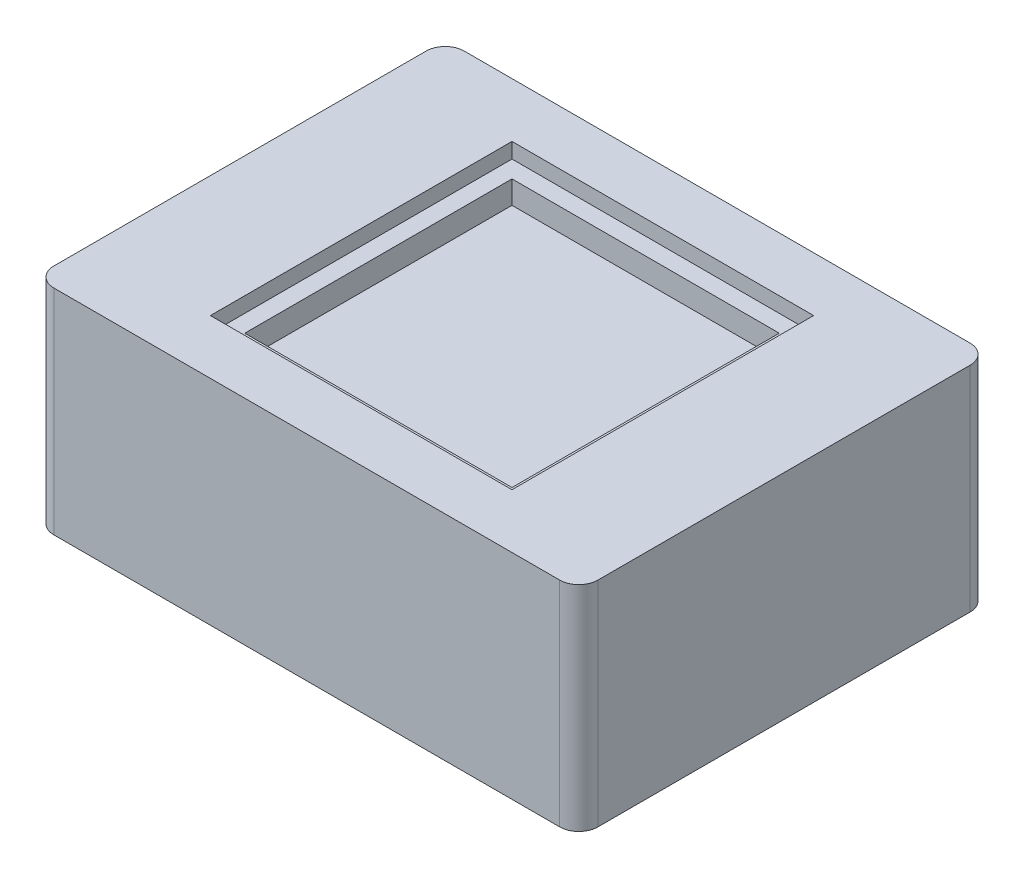
ISO-10303-21;
HEADER;
FILE_DESCRIPTION(('STEP AP214'),'2;1');
FILE_NAME('part.step','',(''),(''),'','','');
FILE_SCHEMA(('AUTOMOTIVE_DESIGN { 1 0 10303 214 1 1 1 1 }'));
ENDSEC;
DATA;
#1=APPLICATION_CONTEXT('core data for automotive mechanical design processes');
#2=APPLICATION_PROTOCOL_DEFINITION('international standard','automotive_design',2000,#1);
#3=PRODUCT_CONTEXT('',#1,'mechanical');
#4=PRODUCT('Part','Part','',(#3));
#5=PRODUCT_RELATED_PRODUCT_CATEGORY('part','',(#4));
#6=PRODUCT_DEFINITION_FORMATION('','',#4);
#7=PRODUCT_DEFINITION_CONTEXT('part definition',#1,'design');
#8=PRODUCT_DEFINITION('design','',#6,#7);
#9=PRODUCT_DEFINITION_SHAPE('','',#8);
#10=(LENGTH_UNIT() NAMED_UNIT(*) SI_UNIT(.MILLI.,.METRE.));
#11=(NAMED_UNIT(*) PLANE_ANGLE_UNIT() SI_UNIT($,.RADIAN.));
#12=(NAMED_UNIT(*) SI_UNIT($,.STERADIAN.) SOLID_ANGLE_UNIT());
#13=UNCERTAINTY_MEASURE_WITH_UNIT(LENGTH_MEASURE(1.E-05),#10,'distance_accuracy_value','');
#14=(GEOMETRIC_REPRESENTATION_CONTEXT(3) GLOBAL_UNCERTAINTY_ASSIGNED_CONTEXT((#13)) GLOBAL_UNIT_ASSIGNED_CONTEXT((#10,
#11,#12)) REPRESENTATION_CONTEXT('',''));
#15=CARTESIAN_POINT('',(0.,0.,0.));
#16=DIRECTION('',(0.,0.,1.));
#17=DIRECTION('',(1.,0.,0.));
#18=AXIS2_PLACEMENT_3D('',#15,#16,#17);
#19=CARTESIAN_POINT('',(14.25,11.2,-10.75));
#20=DIRECTION('',(-1.,0.,0.));
#21=DIRECTION('',(0.,0.,1.));
#22=AXIS2_PLACEMENT_3D('',#19,#20,#21);
#23=PLANE('',#22);
#24=DIRECTION('',(0.,0.,-1.));
#25=VECTOR('',#24,1.);
#26=CARTESIAN_POINT('',(14.25,11.2,-10.75));
#27=LINE('',#26,#25);
#28=CARTESIAN_POINT('',(14.25,11.2,9.75));
#29=VERTEX_POINT('',#28);
#30=CARTESIAN_POINT('',(14.25,11.2,-9.75));
#31=VERTEX_POINT('',#30);
#32=EDGE_CURVE('E219',#29,#31,#27,.T.);
#33=ORIENTED_EDGE('',*,*,#32,.F.);
#34=DIRECTION('',(0.,-1.,0.));
#35=VECTOR('',#34,1.);
#36=CARTESIAN_POINT('',(14.25,11.2,9.75));
#37=LINE('',#36,#35);
#38=CARTESIAN_POINT('',(14.25,0.,9.75));
#39=VERTEX_POINT('',#38);
#40=EDGE_CURVE('E244',#29,#39,#37,.T.);
#41=ORIENTED_EDGE('',*,*,#40,.T.);
#42=DIRECTION('',(0.,0.,-1.));
#43=VECTOR('',#42,1.);
#44=CARTESIAN_POINT('',(14.25,0.,-10.75));
#45=LINE('',#44,#43);
#46=CARTESIAN_POINT('',(14.25,0.,-9.75));
#47=VERTEX_POINT('',#46);
#48=EDGE_CURVE('E210',#39,#47,#45,.T.);
#49=ORIENTED_EDGE('',*,*,#48,.T.);
#50=DIRECTION('',(0.,-1.,0.));
#51=VECTOR('',#50,1.);
#52=CARTESIAN_POINT('',(14.25,11.2,-9.75));
#53=LINE('',#52,#51);
#54=EDGE_CURVE('E232',#47,#31,#53,.F.);
#55=ORIENTED_EDGE('',*,*,#54,.T.);
#56=EDGE_LOOP('',(#33,#41,#49,#55));
#57=FACE_BOUND('',#56,.T.);
#58=ADVANCED_FACE('F39',(#57),#23,.F.);
#59=CARTESIAN_POINT('',(-14.25,11.2,-10.75));
#60=DIRECTION('',(0.,0.,1.));
#61=DIRECTION('',(1.,0.,0.));
#62=AXIS2_PLACEMENT_3D('',#59,#60,#61);
#63=PLANE('',#62);
#64=DIRECTION('',(-1.,0.,0.));
#65=VECTOR('',#64,1.);
#66=CARTESIAN_POINT('',(-14.25,0.,-10.75));
#67=LINE('',#66,#65);
#68=CARTESIAN_POINT('',(13.25,0.,-10.75));
#69=VERTEX_POINT('',#68);
#70=CARTESIAN_POINT('',(-13.25,0.,-10.75));
#71=VERTEX_POINT('',#70);
#72=EDGE_CURVE('E235',#69,#71,#67,.T.);
#73=ORIENTED_EDGE('',*,*,#72,.T.);
#74=DIRECTION('',(0.,-1.,0.));
#75=VECTOR('',#74,1.);
#76=CARTESIAN_POINT('',(-13.25,11.2,-10.75));
#77=LINE('',#76,#75);
#78=CARTESIAN_POINT('',(-13.25,11.2,-10.75));
#79=VERTEX_POINT('',#78);
#80=EDGE_CURVE('E47',#71,#79,#77,.F.);
#81=ORIENTED_EDGE('',*,*,#80,.T.);
#82=DIRECTION('',(-1.,0.,0.));
#83=VECTOR('',#82,1.);
#84=CARTESIAN_POINT('',(-14.25,11.2,-10.75));
#85=LINE('',#84,#83);
#86=CARTESIAN_POINT('',(13.25,11.2,-10.75));
#87=VERTEX_POINT('',#86);
#88=EDGE_CURVE('E222',#87,#79,#85,.T.);
#89=ORIENTED_EDGE('',*,*,#88,.F.);
#90=DIRECTION('',(0.,-1.,0.));
#91=VECTOR('',#90,1.);
#92=CARTESIAN_POINT('',(13.25,11.2,-10.75));
#93=LINE('',#92,#91);
#94=EDGE_CURVE('E273',#87,#69,#93,.T.);
#95=ORIENTED_EDGE('',*,*,#94,.T.);
#96=EDGE_LOOP('',(#73,#81,#89,#95));
#97=FACE_BOUND('',#96,.T.);
#98=ADVANCED_FACE('F278',(#97),#63,.F.);
#99=CARTESIAN_POINT('',(-14.25,11.2,-10.75));
#100=DIRECTION('',(1.,0.,0.));
#101=DIRECTION('',(0.,0.,-1.));
#102=AXIS2_PLACEMENT_3D('',#99,#100,#101);
#103=PLANE('',#102);
#104=DIRECTION('',(0.,0.,1.));
#105=VECTOR('',#104,1.);
#106=CARTESIAN_POINT('',(-14.25,0.,-10.75));
#107=LINE('',#106,#105);
#108=CARTESIAN_POINT('',(-14.25,0.,-9.75));
#109=VERTEX_POINT('',#108);
#110=CARTESIAN_POINT('',(-14.25,0.,9.75));
#111=VERTEX_POINT('',#110);
#112=EDGE_CURVE('E238',#109,#111,#107,.T.);
#113=ORIENTED_EDGE('',*,*,#112,.T.);
#114=DIRECTION('',(0.,-1.,0.));
#115=VECTOR('',#114,1.);
#116=CARTESIAN_POINT('',(-14.25,11.2,9.75));
#117=LINE('',#116,#115);
#118=CARTESIAN_POINT('',(-14.25,11.2,9.75));
#119=VERTEX_POINT('',#118);
#120=EDGE_CURVE('E271',#111,#119,#117,.F.);
#121=ORIENTED_EDGE('',*,*,#120,.T.);
#122=DIRECTION('',(0.,0.,1.));
#123=VECTOR('',#122,1.);
#124=CARTESIAN_POINT('',(-14.25,11.2,-10.75));
#125=LINE('',#124,#123);
#126=CARTESIAN_POINT('',(-14.25,11.2,-9.75));
#127=VERTEX_POINT('',#126);
#128=EDGE_CURVE('E226',#127,#119,#125,.T.);
#129=ORIENTED_EDGE('',*,*,#128,.F.);
#130=DIRECTION('',(0.,-1.,0.));
#131=VECTOR('',#130,1.);
#132=CARTESIAN_POINT('',(-14.25,11.2,-9.75));
#133=LINE('',#132,#131);
#134=EDGE_CURVE('E268',#127,#109,#133,.T.);
#135=ORIENTED_EDGE('',*,*,#134,.T.);
#136=EDGE_LOOP('',(#113,#121,#129,#135));
#137=FACE_BOUND('',#136,.T.);
#138=ADVANCED_FACE('F291',(#137),#103,.F.);
#139=CARTESIAN_POINT('',(-14.25,11.2,10.75));
#140=DIRECTION('',(0.,0.,-1.));
#141=DIRECTION('',(-1.,0.,0.));
#142=AXIS2_PLACEMENT_3D('',#139,#140,#141);
#143=PLANE('',#142);
#144=DIRECTION('',(1.,0.,0.));
#145=VECTOR('',#144,1.);
#146=CARTESIAN_POINT('',(-14.25,0.,10.75));
#147=LINE('',#146,#145);
#148=CARTESIAN_POINT('',(-13.25,0.,10.75));
#149=VERTEX_POINT('',#148);
#150=CARTESIAN_POINT('',(13.25,0.,10.75));
#151=VERTEX_POINT('',#150);
#152=EDGE_CURVE('E223',#149,#151,#147,.T.);
#153=ORIENTED_EDGE('',*,*,#152,.T.);
#154=DIRECTION('',(0.,-1.,0.));
#155=VECTOR('',#154,1.);
#156=CARTESIAN_POINT('',(13.25,11.2,10.75));
#157=LINE('',#156,#155);
#158=CARTESIAN_POINT('',(13.25,11.2,10.75));
#159=VERTEX_POINT('',#158);
#160=EDGE_CURVE('E258',#151,#159,#157,.F.);
#161=ORIENTED_EDGE('',*,*,#160,.T.);
#162=DIRECTION('',(1.,0.,0.));
#163=VECTOR('',#162,1.);
#164=CARTESIAN_POINT('',(-14.25,11.2,10.75));
#165=LINE('',#164,#163);
#166=CARTESIAN_POINT('',(-13.25,11.2,10.75));
#167=VERTEX_POINT('',#166);
#168=EDGE_CURVE('E229',#167,#159,#165,.T.);
#169=ORIENTED_EDGE('',*,*,#168,.F.);
#170=DIRECTION('',(0.,-1.,0.));
#171=VECTOR('',#170,1.);
#172=CARTESIAN_POINT('',(-13.25,11.2,10.75));
#173=LINE('',#172,#171);
#174=EDGE_CURVE('E255',#167,#149,#173,.T.);
#175=ORIENTED_EDGE('',*,*,#174,.T.);
#176=EDGE_LOOP('',(#153,#161,#169,#175));
#177=FACE_BOUND('',#176,.T.);
#178=ADVANCED_FACE('F303',(#177),#143,.F.);
#179=CARTESIAN_POINT('',(0.,11.2,0.));
#180=DIRECTION('',(0.,1.,0.));
#181=DIRECTION('',(0.,0.,1.));
#182=AXIS2_PLACEMENT_3D('',#179,#180,#181);
#183=PLANE('',#182);
#184=DIRECTION('',(1.,0.,0.));
#185=VECTOR('',#184,1.);
#186=CARTESIAN_POINT('',(-7.9,11.2,7.9));
#187=LINE('',#186,#185);
#188=CARTESIAN_POINT('',(-7.9,11.2,7.9));
#189=VERTEX_POINT('',#188);
#190=CARTESIAN_POINT('',(7.9,11.2,7.9));
#191=VERTEX_POINT('',#190);
#192=EDGE_CURVE('E54',#189,#191,#187,.T.);
#193=ORIENTED_EDGE('',*,*,#192,.F.);
#194=DIRECTION('',(0.,0.,1.));
#195=VECTOR('',#194,1.);
#196=CARTESIAN_POINT('',(-7.9,11.2,-7.9));
#197=LINE('',#196,#195);
#198=CARTESIAN_POINT('',(-7.9,11.2,-7.9));
#199=VERTEX_POINT('',#198);
#200=EDGE_CURVE('E171',#199,#189,#197,.T.);
#201=ORIENTED_EDGE('',*,*,#200,.F.);
#202=DIRECTION('',(1.,0.,0.));
#203=VECTOR('',#202,1.);
#204=CARTESIAN_POINT('',(-7.9,11.2,-7.9));
#205=LINE('',#204,#203);
#206=CARTESIAN_POINT('',(7.9,11.2,-7.9));
#207=VERTEX_POINT('',#206);
#208=EDGE_CURVE('E174',#199,#207,#205,.T.);
#209=ORIENTED_EDGE('',*,*,#208,.T.);
#210=DIRECTION('',(0.,0.,1.));
#211=VECTOR('',#210,1.);
#212=CARTESIAN_POINT('',(7.9,11.2,-7.9));
#213=LINE('',#212,#211);
#214=EDGE_CURVE('E180',#207,#191,#213,.T.);
#215=ORIENTED_EDGE('',*,*,#214,.T.);
#216=EDGE_LOOP('',(#193,#201,#209,#215));
#217=FACE_BOUND('',#216,.T.);
#218=ORIENTED_EDGE('',*,*,#168,.T.);
#219=CARTESIAN_POINT('',(13.25,11.2,9.75));
#220=DIRECTION('',(0.,1.,0.));
#221=DIRECTION('',(0.,0.,1.));
#222=AXIS2_PLACEMENT_3D('',#219,#220,#221);
#223=CIRCLE('',#222,1.);
#224=EDGE_CURVE('E266',#159,#29,#223,.T.);
#225=ORIENTED_EDGE('',*,*,#224,.T.);
#226=ORIENTED_EDGE('',*,*,#32,.T.);
#227=CARTESIAN_POINT('',(13.25,11.2,-9.75));
#228=DIRECTION('',(0.,1.,0.));
#229=DIRECTION('',(0.,0.,1.));
#230=AXIS2_PLACEMENT_3D('',#227,#228,#229);
#231=CIRCLE('',#230,1.);
#232=EDGE_CURVE('E260',#31,#87,#231,.T.);
#233=ORIENTED_EDGE('',*,*,#232,.T.);
#234=ORIENTED_EDGE('',*,*,#88,.T.);
#235=CARTESIAN_POINT('',(-13.25,11.2,-9.75));
#236=DIRECTION('',(0.,1.,0.));
#237=DIRECTION('',(0.,0.,1.));
#238=AXIS2_PLACEMENT_3D('',#235,#236,#237);
#239=CIRCLE('',#238,1.);
#240=EDGE_CURVE('E262',#79,#127,#239,.T.);
#241=ORIENTED_EDGE('',*,*,#240,.T.);
#242=ORIENTED_EDGE('',*,*,#128,.T.);
#243=CARTESIAN_POINT('',(-13.25,11.2,9.75));
#244=DIRECTION('',(0.,1.,0.));
#245=DIRECTION('',(0.,0.,1.));
#246=AXIS2_PLACEMENT_3D('',#243,#244,#245);
#247=CIRCLE('',#246,1.);
#248=EDGE_CURVE('E264',#119,#167,#247,.T.);
#249=ORIENTED_EDGE('',*,*,#248,.T.);
#250=EDGE_LOOP('',(#218,#225,#226,#233,#234,#241,#242,#249));
#251=FACE_BOUND('',#250,.T.);
#252=ADVANCED_FACE('F284',(#217,#251),#183,.T.);
#253=CARTESIAN_POINT('',(0.,0.,0.));
#254=DIRECTION('',(0.,1.,0.));
#255=DIRECTION('',(0.,0.,1.));
#256=AXIS2_PLACEMENT_3D('',#253,#254,#255);
#257=PLANE('',#256);
#258=ORIENTED_EDGE('',*,*,#48,.F.);
#259=CARTESIAN_POINT('',(13.25,0.,9.75));
#260=DIRECTION('',(0.,1.,0.));
#261=DIRECTION('',(0.,0.,1.));
#262=AXIS2_PLACEMENT_3D('',#259,#260,#261);
#263=CIRCLE('',#262,1.);
#264=EDGE_CURVE('E253',#39,#151,#263,.F.);
#265=ORIENTED_EDGE('',*,*,#264,.T.);
#266=ORIENTED_EDGE('',*,*,#152,.F.);
#267=CARTESIAN_POINT('',(-13.25,0.,9.75));
#268=DIRECTION('',(0.,1.,0.));
#269=DIRECTION('',(0.,0.,1.));
#270=AXIS2_PLACEMENT_3D('',#267,#268,#269);
#271=CIRCLE('',#270,1.);
#272=EDGE_CURVE('E251',#149,#111,#271,.F.);
#273=ORIENTED_EDGE('',*,*,#272,.T.);
#274=ORIENTED_EDGE('',*,*,#112,.F.);
#275=CARTESIAN_POINT('',(-13.25,0.,-9.75));
#276=DIRECTION('',(0.,1.,0.));
#277=DIRECTION('',(0.,0.,1.));
#278=AXIS2_PLACEMENT_3D('',#275,#276,#277);
#279=CIRCLE('',#278,1.);
#280=EDGE_CURVE('E249',#109,#71,#279,.F.);
#281=ORIENTED_EDGE('',*,*,#280,.T.);
#282=ORIENTED_EDGE('',*,*,#72,.F.);
#283=CARTESIAN_POINT('',(13.25,0.,-9.75));
#284=DIRECTION('',(0.,1.,0.));
#285=DIRECTION('',(0.,0.,1.));
#286=AXIS2_PLACEMENT_3D('',#283,#284,#285);
#287=CIRCLE('',#286,1.);
#288=EDGE_CURVE('E247',#69,#47,#287,.F.);
#289=ORIENTED_EDGE('',*,*,#288,.T.);
#290=EDGE_LOOP('',(#258,#265,#266,#273,#274,#281,#282,#289));
#291=FACE_BOUND('',#290,.T.);
#292=ADVANCED_FACE('F295',(#291),#257,.F.);
#293=CARTESIAN_POINT('',(13.25,11.2,9.75));
#294=DIRECTION('',(0.,-1.,0.));
#295=DIRECTION('',(0.,0.,-1.));
#296=AXIS2_PLACEMENT_3D('',#293,#294,#295);
#297=CYLINDRICAL_SURFACE('',#296,1.);
#298=ORIENTED_EDGE('',*,*,#224,.F.);
#299=ORIENTED_EDGE('',*,*,#160,.F.);
#300=ORIENTED_EDGE('',*,*,#264,.F.);
#301=ORIENTED_EDGE('',*,*,#40,.F.);
#302=EDGE_LOOP('',(#298,#299,#300,#301));
#303=FACE_BOUND('',#302,.T.);
#304=ADVANCED_FACE('F309',(#303),#297,.T.);
#305=CARTESIAN_POINT('',(-13.25,11.2,9.75));
#306=DIRECTION('',(0.,-1.,0.));
#307=DIRECTION('',(0.,0.,-1.));
#308=AXIS2_PLACEMENT_3D('',#305,#306,#307);
#309=CYLINDRICAL_SURFACE('',#308,1.);
#310=ORIENTED_EDGE('',*,*,#248,.F.);
#311=ORIENTED_EDGE('',*,*,#120,.F.);
#312=ORIENTED_EDGE('',*,*,#272,.F.);
#313=ORIENTED_EDGE('',*,*,#174,.F.);
#314=EDGE_LOOP('',(#310,#311,#312,#313));
#315=FACE_BOUND('',#314,.T.);
#316=ADVANCED_FACE('F300',(#315),#309,.T.);
#317=CARTESIAN_POINT('',(-13.25,11.2,-9.75));
#318=DIRECTION('',(0.,-1.,0.));
#319=DIRECTION('',(0.,0.,-1.));
#320=AXIS2_PLACEMENT_3D('',#317,#318,#319);
#321=CYLINDRICAL_SURFACE('',#320,1.);
#322=ORIENTED_EDGE('',*,*,#240,.F.);
#323=ORIENTED_EDGE('',*,*,#80,.F.);
#324=ORIENTED_EDGE('',*,*,#280,.F.);
#325=ORIENTED_EDGE('',*,*,#134,.F.);
#326=EDGE_LOOP('',(#322,#323,#324,#325));
#327=FACE_BOUND('',#326,.T.);
#328=ADVANCED_FACE('F288',(#327),#321,.T.);
#329=CARTESIAN_POINT('',(13.25,11.2,-9.75));
#330=DIRECTION('',(0.,-1.,0.));
#331=DIRECTION('',(0.,0.,-1.));
#332=AXIS2_PLACEMENT_3D('',#329,#330,#331);
#333=CYLINDRICAL_SURFACE('',#332,1.);
#334=ORIENTED_EDGE('',*,*,#232,.F.);
#335=ORIENTED_EDGE('',*,*,#54,.F.);
#336=ORIENTED_EDGE('',*,*,#288,.F.);
#337=ORIENTED_EDGE('',*,*,#94,.F.);
#338=EDGE_LOOP('',(#334,#335,#336,#337));
#339=FACE_BOUND('',#338,.T.);
#340=ADVANCED_FACE('F41',(#339),#333,.T.);
#341=CARTESIAN_POINT('',(0.,10.4,0.));
#342=DIRECTION('',(0.,-1.,0.));
#343=DIRECTION('',(0.,0.,-1.));
#344=AXIS2_PLACEMENT_3D('',#341,#342,#343);
#345=PLANE('',#344);
#346=DIRECTION('',(1.,0.,0.));
#347=VECTOR('',#346,1.);
#348=CARTESIAN_POINT('',(-7.9,10.4,7.9));
#349=LINE('',#348,#347);
#350=CARTESIAN_POINT('',(-7.9,10.4,7.9));
#351=VERTEX_POINT('',#350);
#352=CARTESIAN_POINT('',(7.9,10.4,7.9));
#353=VERTEX_POINT('',#352);
#354=EDGE_CURVE('E162',#351,#353,#349,.T.);
#355=ORIENTED_EDGE('',*,*,#354,.T.);
#356=DIRECTION('',(0.,0.,1.));
#357=VECTOR('',#356,1.);
#358=CARTESIAN_POINT('',(7.9,10.4,-7.9));
#359=LINE('',#358,#357);
#360=CARTESIAN_POINT('',(7.9,10.4,-7.9));
#361=VERTEX_POINT('',#360);
#362=EDGE_CURVE('E152',#361,#353,#359,.T.);
#363=ORIENTED_EDGE('',*,*,#362,.F.);
#364=DIRECTION('',(1.,0.,0.));
#365=VECTOR('',#364,1.);
#366=CARTESIAN_POINT('',(-7.9,10.4,-7.9));
#367=LINE('',#366,#365);
#368=CARTESIAN_POINT('',(-7.9,10.4,-7.9));
#369=VERTEX_POINT('',#368);
#370=EDGE_CURVE('E161',#369,#361,#367,.T.);
#371=ORIENTED_EDGE('',*,*,#370,.F.);
#372=DIRECTION('',(0.,0.,1.));
#373=VECTOR('',#372,1.);
#374=CARTESIAN_POINT('',(-7.9,10.4,-7.9));
#375=LINE('',#374,#373);
#376=EDGE_CURVE('E167',#369,#351,#375,.T.);
#377=ORIENTED_EDGE('',*,*,#376,.T.);
#378=EDGE_LOOP('',(#355,#363,#371,#377));
#379=FACE_BOUND('',#378,.T.);
#380=DIRECTION('',(0.,0.,1.));
#381=VECTOR('',#380,1.);
#382=CARTESIAN_POINT('',(-7.,10.4,-7.));
#383=LINE('',#382,#381);
#384=CARTESIAN_POINT('',(-7.,10.4,-7.));
#385=VERTEX_POINT('',#384);
#386=CARTESIAN_POINT('',(-7.,10.4,7.));
#387=VERTEX_POINT('',#386);
#388=EDGE_CURVE('E190',#385,#387,#383,.T.);
#389=ORIENTED_EDGE('',*,*,#388,.F.);
#390=DIRECTION('',(1.,0.,0.));
#391=VECTOR('',#390,1.);
#392=CARTESIAN_POINT('',(-7.,10.4,-7.));
#393=LINE('',#392,#391);
#394=CARTESIAN_POINT('',(7.,10.4,-7.));
#395=VERTEX_POINT('',#394);
#396=EDGE_CURVE('E61',#385,#395,#393,.T.);
#397=ORIENTED_EDGE('',*,*,#396,.T.);
#398=DIRECTION('',(0.,0.,1.));
#399=VECTOR('',#398,1.);
#400=CARTESIAN_POINT('',(7.,10.4,-7.));
#401=LINE('',#400,#399);
#402=CARTESIAN_POINT('',(7.,10.4,7.));
#403=VERTEX_POINT('',#402);
#404=EDGE_CURVE('E11',#395,#403,#401,.T.);
#405=ORIENTED_EDGE('',*,*,#404,.T.);
#406=DIRECTION('',(1.,0.,0.));
#407=VECTOR('',#406,1.);
#408=CARTESIAN_POINT('',(-7.,10.4,7.));
#409=LINE('',#408,#407);
#410=EDGE_CURVE('E193',#387,#403,#409,.T.);
#411=ORIENTED_EDGE('',*,*,#410,.F.);
#412=EDGE_LOOP('',(#389,#397,#405,#411));
#413=FACE_BOUND('',#412,.T.);
#414=ADVANCED_FACE('F169',(#379,#413),#345,.F.);
#415=CARTESIAN_POINT('',(-7.9,10.4,7.9));
#416=DIRECTION('',(0.,0.,1.));
#417=DIRECTION('',(1.,0.,0.));
#418=AXIS2_PLACEMENT_3D('',#415,#416,#417);
#419=PLANE('',#418);
#420=ORIENTED_EDGE('',*,*,#192,.T.);
#421=DIRECTION('',(0.,1.,0.));
#422=VECTOR('',#421,1.);
#423=CARTESIAN_POINT('',(7.9,10.4,7.9));
#424=LINE('',#423,#422);
#425=EDGE_CURVE('E155',#353,#191,#424,.T.);
#426=ORIENTED_EDGE('',*,*,#425,.F.);
#427=ORIENTED_EDGE('',*,*,#354,.F.);
#428=DIRECTION('',(0.,1.,0.));
#429=VECTOR('',#428,1.);
#430=CARTESIAN_POINT('',(-7.9,10.4,7.9));
#431=LINE('',#430,#429);
#432=EDGE_CURVE('E184',#351,#189,#431,.T.);
#433=ORIENTED_EDGE('',*,*,#432,.T.);
#434=EDGE_LOOP('',(#420,#426,#427,#433));
#435=FACE_BOUND('',#434,.T.);
#436=ADVANCED_FACE('F165',(#435),#419,.F.);
#437=CARTESIAN_POINT('',(-7.9,10.4,-7.9));
#438=DIRECTION('',(-1.,0.,0.));
#439=DIRECTION('',(0.,0.,1.));
#440=AXIS2_PLACEMENT_3D('',#437,#438,#439);
#441=PLANE('',#440);
#442=ORIENTED_EDGE('',*,*,#200,.T.);
#443=ORIENTED_EDGE('',*,*,#432,.F.);
#444=ORIENTED_EDGE('',*,*,#376,.F.);
#445=DIRECTION('',(0.,1.,0.));
#446=VECTOR('',#445,1.);
#447=CARTESIAN_POINT('',(-7.9,10.4,-7.9));
#448=LINE('',#447,#446);
#449=EDGE_CURVE('E186',#369,#199,#448,.T.);
#450=ORIENTED_EDGE('',*,*,#449,.T.);
#451=EDGE_LOOP('',(#442,#443,#444,#450));
#452=FACE_BOUND('',#451,.T.);
#453=ADVANCED_FACE('F394',(#452),#441,.F.);
#454=CARTESIAN_POINT('',(-7.9,10.4,-7.9));
#455=DIRECTION('',(0.,0.,1.));
#456=DIRECTION('',(1.,0.,0.));
#457=AXIS2_PLACEMENT_3D('',#454,#455,#456);
#458=PLANE('',#457);
#459=ORIENTED_EDGE('',*,*,#208,.F.);
#460=ORIENTED_EDGE('',*,*,#449,.F.);
#461=ORIENTED_EDGE('',*,*,#370,.T.);
#462=DIRECTION('',(0.,1.,0.));
#463=VECTOR('',#462,1.);
#464=CARTESIAN_POINT('',(7.9,10.4,-7.9));
#465=LINE('',#464,#463);
#466=EDGE_CURVE('E157',#361,#207,#465,.T.);
#467=ORIENTED_EDGE('',*,*,#466,.T.);
#468=EDGE_LOOP('',(#459,#460,#461,#467));
#469=FACE_BOUND('',#468,.T.);
#470=ADVANCED_FACE('F401',(#469),#458,.T.);
#471=CARTESIAN_POINT('',(7.9,10.4,-7.9));
#472=DIRECTION('',(-1.,0.,0.));
#473=DIRECTION('',(0.,0.,1.));
#474=AXIS2_PLACEMENT_3D('',#471,#472,#473);
#475=PLANE('',#474);
#476=ORIENTED_EDGE('',*,*,#214,.F.);
#477=ORIENTED_EDGE('',*,*,#466,.F.);
#478=ORIENTED_EDGE('',*,*,#362,.T.);
#479=ORIENTED_EDGE('',*,*,#425,.T.);
#480=EDGE_LOOP('',(#476,#477,#478,#479));
#481=FACE_BOUND('',#480,.T.);
#482=ADVANCED_FACE('F154',(#481),#475,.T.);
#483=CARTESIAN_POINT('',(0.,9.2,0.));
#484=DIRECTION('',(0.,-1.,0.));
#485=DIRECTION('',(0.,0.,-1.));
#486=AXIS2_PLACEMENT_3D('',#483,#484,#485);
#487=PLANE('',#486);
#488=DIRECTION('',(1.,0.,0.));
#489=VECTOR('',#488,1.);
#490=CARTESIAN_POINT('',(-7.,9.2,7.));
#491=LINE('',#490,#489);
#492=CARTESIAN_POINT('',(-7.,9.2,7.));
#493=VERTEX_POINT('',#492);
#494=CARTESIAN_POINT('',(7.,9.2,7.));
#495=VERTEX_POINT('',#494);
#496=EDGE_CURVE('E196',#493,#495,#491,.T.);
#497=ORIENTED_EDGE('',*,*,#496,.T.);
#498=DIRECTION('',(0.,0.,1.));
#499=VECTOR('',#498,1.);
#500=CARTESIAN_POINT('',(7.,9.2,-7.));
#501=LINE('',#500,#499);
#502=CARTESIAN_POINT('',(7.,9.2,-7.));
#503=VERTEX_POINT('',#502);
#504=EDGE_CURVE('E199',#503,#495,#501,.T.);
#505=ORIENTED_EDGE('',*,*,#504,.F.);
#506=DIRECTION('',(1.,0.,0.));
#507=VECTOR('',#506,1.);
#508=CARTESIAN_POINT('',(-7.,9.2,-7.));
#509=LINE('',#508,#507);
#510=CARTESIAN_POINT('',(-7.,9.2,-7.));
#511=VERTEX_POINT('',#510);
#512=EDGE_CURVE('E201',#511,#503,#509,.T.);
#513=ORIENTED_EDGE('',*,*,#512,.F.);
#514=DIRECTION('',(0.,0.,1.));
#515=VECTOR('',#514,1.);
#516=CARTESIAN_POINT('',(-7.,9.2,-7.));
#517=LINE('',#516,#515);
#518=EDGE_CURVE('E203',#511,#493,#517,.T.);
#519=ORIENTED_EDGE('',*,*,#518,.T.);
#520=EDGE_LOOP('',(#497,#505,#513,#519));
#521=FACE_BOUND('',#520,.T.);
#522=ADVANCED_FACE('F374',(#521),#487,.F.);
#523=CARTESIAN_POINT('',(7.,9.2,-7.));
#524=DIRECTION('',(-1.,0.,0.));
#525=DIRECTION('',(0.,0.,1.));
#526=AXIS2_PLACEMENT_3D('',#523,#524,#525);
#527=PLANE('',#526);
#528=ORIENTED_EDGE('',*,*,#404,.F.);
#529=DIRECTION('',(0.,1.,0.));
#530=VECTOR('',#529,1.);
#531=CARTESIAN_POINT('',(7.,9.2,-7.));
#532=LINE('',#531,#530);
#533=EDGE_CURVE('E214',#503,#395,#532,.T.);
#534=ORIENTED_EDGE('',*,*,#533,.F.);
#535=ORIENTED_EDGE('',*,*,#504,.T.);
#536=DIRECTION('',(0.,1.,0.));
#537=VECTOR('',#536,1.);
#538=CARTESIAN_POINT('',(7.,9.2,7.));
#539=LINE('',#538,#537);
#540=EDGE_CURVE('E206',#495,#403,#539,.T.);
#541=ORIENTED_EDGE('',*,*,#540,.T.);
#542=EDGE_LOOP('',(#528,#534,#535,#541));
#543=FACE_BOUND('',#542,.T.);
#544=ADVANCED_FACE('F366',(#543),#527,.T.);
#545=CARTESIAN_POINT('',(-7.,9.2,-7.));
#546=DIRECTION('',(0.,0.,1.));
#547=DIRECTION('',(1.,0.,0.));
#548=AXIS2_PLACEMENT_3D('',#545,#546,#547);
#549=PLANE('',#548);
#550=ORIENTED_EDGE('',*,*,#396,.F.);
#551=DIRECTION('',(0.,1.,0.));
#552=VECTOR('',#551,1.);
#553=CARTESIAN_POINT('',(-7.,9.2,-7.));
#554=LINE('',#553,#552);
#555=EDGE_CURVE('E211',#511,#385,#554,.T.);
#556=ORIENTED_EDGE('',*,*,#555,.F.);
#557=ORIENTED_EDGE('',*,*,#512,.T.);
#558=ORIENTED_EDGE('',*,*,#533,.T.);
#559=EDGE_LOOP('',(#550,#556,#557,#558));
#560=FACE_BOUND('',#559,.T.);
#561=ADVANCED_FACE('F358',(#560),#549,.T.);
#562=CARTESIAN_POINT('',(-7.,9.2,-7.));
#563=DIRECTION('',(-1.,0.,0.));
#564=DIRECTION('',(0.,0.,1.));
#565=AXIS2_PLACEMENT_3D('',#562,#563,#564);
#566=PLANE('',#565);
#567=ORIENTED_EDGE('',*,*,#555,.T.);
#568=ORIENTED_EDGE('',*,*,#388,.T.);
#569=DIRECTION('',(0.,1.,0.));
#570=VECTOR('',#569,1.);
#571=CARTESIAN_POINT('',(-7.,9.2,7.));
#572=LINE('',#571,#570);
#573=EDGE_CURVE('E207',#493,#387,#572,.T.);
#574=ORIENTED_EDGE('',*,*,#573,.F.);
#575=ORIENTED_EDGE('',*,*,#518,.F.);
#576=EDGE_LOOP('',(#567,#568,#574,#575));
#577=FACE_BOUND('',#576,.T.);
#578=ADVANCED_FACE('F350',(#577),#566,.F.);
#579=CARTESIAN_POINT('',(-7.,9.2,7.));
#580=DIRECTION('',(0.,0.,1.));
#581=DIRECTION('',(1.,0.,0.));
#582=AXIS2_PLACEMENT_3D('',#579,#580,#581);
#583=PLANE('',#582);
#584=ORIENTED_EDGE('',*,*,#573,.T.);
#585=ORIENTED_EDGE('',*,*,#410,.T.);
#586=ORIENTED_EDGE('',*,*,#540,.F.);
#587=ORIENTED_EDGE('',*,*,#496,.F.);
#588=EDGE_LOOP('',(#584,#585,#586,#587));
#589=FACE_BOUND('',#588,.T.);
#590=ADVANCED_FACE('F345',(#589),#583,.F.);
#591=CLOSED_SHELL('',(#58,#98,#138,#178,#252,#292,#304,#316,#328,#340,#414,#436,#453,#470,#482,
#522,#544,#561,#578,#590));
#592=MANIFOLD_SOLID_BREP('B2',#591);
#593=ADVANCED_BREP_SHAPE_REPRESENTATION('',(#18,#592),#14);
#594=SHAPE_DEFINITION_REPRESENTATION(#9,#593);
ENDSEC;
END-ISO-10303-21;
